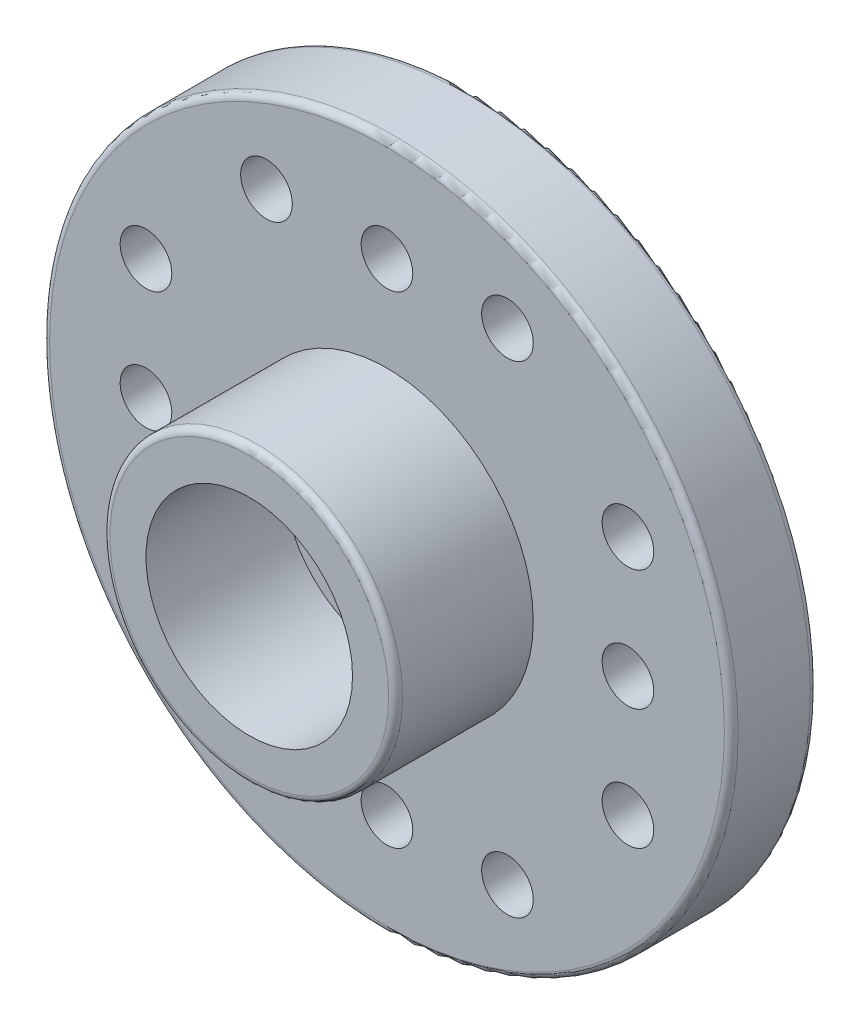
ISO-10303-21;
HEADER;
FILE_DESCRIPTION(('STEP AP214'),'2;1');
FILE_NAME('part.step','',(''),(''),'','','');
FILE_SCHEMA(('AUTOMOTIVE_DESIGN { 1 0 10303 214 1 1 1 1 }'));
ENDSEC;
DATA;
#1=APPLICATION_CONTEXT('core data for automotive mechanical design processes');
#2=APPLICATION_PROTOCOL_DEFINITION('international standard','automotive_design',2000,#1);
#3=PRODUCT_CONTEXT('',#1,'mechanical');
#4=PRODUCT('Part','Part','',(#3));
#5=PRODUCT_RELATED_PRODUCT_CATEGORY('part','',(#4));
#6=PRODUCT_DEFINITION_FORMATION('','',#4);
#7=PRODUCT_DEFINITION_CONTEXT('part definition',#1,'design');
#8=PRODUCT_DEFINITION('design','',#6,#7);
#9=PRODUCT_DEFINITION_SHAPE('','',#8);
#10=(LENGTH_UNIT() NAMED_UNIT(*) SI_UNIT(.MILLI.,.METRE.));
#11=(NAMED_UNIT(*) PLANE_ANGLE_UNIT() SI_UNIT($,.RADIAN.));
#12=(NAMED_UNIT(*) SI_UNIT($,.STERADIAN.) SOLID_ANGLE_UNIT());
#13=UNCERTAINTY_MEASURE_WITH_UNIT(LENGTH_MEASURE(1.E-05),#10,'distance_accuracy_value','');
#14=(GEOMETRIC_REPRESENTATION_CONTEXT(3) GLOBAL_UNCERTAINTY_ASSIGNED_CONTEXT((#13)) GLOBAL_UNIT_ASSIGNED_CONTEXT((#10,
#11,#12)) REPRESENTATION_CONTEXT('',''));
#15=CARTESIAN_POINT('',(0.,0.,0.));
#16=DIRECTION('',(0.,0.,1.));
#17=DIRECTION('',(1.,0.,0.));
#18=AXIS2_PLACEMENT_3D('',#15,#16,#17);
#19=CARTESIAN_POINT('',(0.,0.,0.8));
#20=DIRECTION('',(0.,0.,-1.));
#21=DIRECTION('',(-1.,0.,0.));
#22=AXIS2_PLACEMENT_3D('',#19,#20,#21);
#23=PLANE('',#22);
#24=CARTESIAN_POINT('',(0.,0.,0.8));
#25=DIRECTION('',(0.,0.,-1.));
#26=DIRECTION('',(-1.,0.,0.));
#27=AXIS2_PLACEMENT_3D('',#24,#25,#26);
#28=CIRCLE('',#27,4.5);
#29=CARTESIAN_POINT('',(-4.5,0.,0.8));
#30=VERTEX_POINT('',#29);
#31=EDGE_CURVE('E74',#30,#30,#28,.T.);
#32=ORIENTED_EDGE('',*,*,#31,.T.);
#33=EDGE_LOOP('',(#32));
#34=FACE_BOUND('',#33,.T.);
#35=CARTESIAN_POINT('',(-0.162730826685293,0.,0.8));
#36=DIRECTION('',(0.,0.,-1.));
#37=DIRECTION('',(-1.,0.,0.));
#38=AXIS2_PLACEMENT_3D('',#35,#36,#37);
#39=CIRCLE('',#38,3.7);
#40=CARTESIAN_POINT('',(-3.86273082668529,0.,0.8));
#41=VERTEX_POINT('',#40);
#42=EDGE_CURVE('E162',#41,#41,#39,.T.);
#43=ORIENTED_EDGE('',*,*,#42,.F.);
#44=EDGE_LOOP('',(#43));
#45=FACE_BOUND('',#44,.T.);
#46=ADVANCED_FACE('F34',(#34,#45),#23,.T.);
#47=CARTESIAN_POINT('',(0.,0.,2.5));
#48=DIRECTION('',(0.,0.,-1.));
#49=DIRECTION('',(-1.,0.,0.));
#50=AXIS2_PLACEMENT_3D('',#47,#48,#49);
#51=CYLINDRICAL_SURFACE('',#50,1.5);
#52=CARTESIAN_POINT('',(0.,0.,2.5));
#53=DIRECTION('',(0.,0.,1.));
#54=DIRECTION('',(1.,0.,0.));
#55=AXIS2_PLACEMENT_3D('',#52,#53,#54);
#56=CIRCLE('',#55,1.5);
#57=CARTESIAN_POINT('',(1.5,0.,2.5));
#58=VERTEX_POINT('',#57);
#59=EDGE_CURVE('E147',#58,#58,#56,.T.);
#60=ORIENTED_EDGE('',*,*,#59,.T.);
#61=EDGE_LOOP('',(#60));
#62=FACE_BOUND('',#61,.T.);
#63=CARTESIAN_POINT('',(0.,0.,0.8));
#64=DIRECTION('',(0.,0.,-1.));
#65=DIRECTION('',(-1.,0.,0.));
#66=AXIS2_PLACEMENT_3D('',#63,#64,#65);
#67=CIRCLE('',#66,1.5);
#68=CARTESIAN_POINT('',(-1.5,0.,0.8));
#69=VERTEX_POINT('',#68);
#70=EDGE_CURVE('E70',#69,#69,#67,.T.);
#71=ORIENTED_EDGE('',*,*,#70,.T.);
#72=EDGE_LOOP('',(#71));
#73=FACE_BOUND('',#72,.T.);
#74=ADVANCED_FACE('F172',(#62,#73),#51,.F.);
#75=CARTESIAN_POINT('',(0.,0.,2.5));
#76=DIRECTION('',(0.,0.,1.));
#77=DIRECTION('',(1.,0.,0.));
#78=AXIS2_PLACEMENT_3D('',#75,#76,#77);
#79=PLANE('',#78);
#80=CARTESIAN_POINT('',(0.,0.,2.5));
#81=DIRECTION('',(0.,0.,1.));
#82=DIRECTION('',(1.,0.,0.));
#83=AXIS2_PLACEMENT_3D('',#80,#81,#82);
#84=CIRCLE('',#83,9.79999999999866);
#85=CARTESIAN_POINT('',(9.79999999999866,0.,2.5));
#86=VERTEX_POINT('',#85);
#87=EDGE_CURVE('E10',#86,#86,#84,.T.);
#88=ORIENTED_EDGE('',*,*,#87,.T.);
#89=EDGE_LOOP('',(#88));
#90=FACE_BOUND('',#89,.T.);
#91=CARTESIAN_POINT('',(-7.,3.5,2.5));
#92=DIRECTION('',(0.,0.,1.));
#93=DIRECTION('',(1.,0.,0.));
#94=AXIS2_PLACEMENT_3D('',#91,#92,#93);
#95=CIRCLE('',#94,0.749999999999998);
#96=CARTESIAN_POINT('',(-6.25,3.5,2.5));
#97=VERTEX_POINT('',#96);
#98=EDGE_CURVE('E141',#97,#97,#95,.T.);
#99=ORIENTED_EDGE('',*,*,#98,.F.);
#100=EDGE_LOOP('',(#99));
#101=FACE_BOUND('',#100,.T.);
#102=CARTESIAN_POINT('',(-3.49999999999973,-6.99999999999993,2.5));
#103=DIRECTION('',(0.,0.,1.));
#104=DIRECTION('',(1.,0.,0.));
#105=AXIS2_PLACEMENT_3D('',#102,#103,#104);
#106=CIRCLE('',#105,0.749999999999999);
#107=CARTESIAN_POINT('',(-2.74999999999974,-6.99999999999993,2.5));
#108=VERTEX_POINT('',#107);
#109=EDGE_CURVE('E129',#108,#108,#106,.T.);
#110=ORIENTED_EDGE('',*,*,#109,.F.);
#111=EDGE_LOOP('',(#110));
#112=FACE_BOUND('',#111,.T.);
#113=CARTESIAN_POINT('',(2.65831209225568E-13,-6.99999999999993,2.5));
#114=DIRECTION('',(0.,0.,1.));
#115=DIRECTION('',(1.,0.,0.));
#116=AXIS2_PLACEMENT_3D('',#113,#114,#115);
#117=CIRCLE('',#116,0.749999999999999);
#118=CARTESIAN_POINT('',(0.750000000000265,-6.99999999999993,2.5));
#119=VERTEX_POINT('',#118);
#120=EDGE_CURVE('E117',#119,#119,#117,.T.);
#121=ORIENTED_EDGE('',*,*,#120,.F.);
#122=EDGE_LOOP('',(#121));
#123=FACE_BOUND('',#122,.T.);
#124=CARTESIAN_POINT('',(7.0000000000002,3.50000000000033,2.5));
#125=DIRECTION('',(0.,0.,1.));
#126=DIRECTION('',(1.,0.,0.));
#127=AXIS2_PLACEMENT_3D('',#124,#125,#126);
#128=CIRCLE('',#127,0.749999999999998);
#129=CARTESIAN_POINT('',(7.7500000000002,3.50000000000033,2.5));
#130=VERTEX_POINT('',#129);
#131=EDGE_CURVE('E105',#130,#130,#128,.T.);
#132=ORIENTED_EDGE('',*,*,#131,.F.);
#133=EDGE_LOOP('',(#132));
#134=FACE_BOUND('',#133,.T.);
#135=CARTESIAN_POINT('',(3.49999999999993,7.00000000000027,2.5));
#136=DIRECTION('',(0.,0.,1.));
#137=DIRECTION('',(1.,0.,0.));
#138=AXIS2_PLACEMENT_3D('',#135,#136,#137);
#139=CIRCLE('',#138,0.749999999999999);
#140=CARTESIAN_POINT('',(4.24999999999993,7.00000000000027,2.5));
#141=VERTEX_POINT('',#140);
#142=EDGE_CURVE('E93',#141,#141,#139,.T.);
#143=ORIENTED_EDGE('',*,*,#142,.F.);
#144=EDGE_LOOP('',(#143));
#145=FACE_BOUND('',#144,.T.);
#146=CARTESIAN_POINT('',(0.,7.00000000000026,2.5));
#147=DIRECTION('',(0.,0.,1.));
#148=DIRECTION('',(1.,0.,0.));
#149=AXIS2_PLACEMENT_3D('',#146,#147,#148);
#150=CIRCLE('',#149,0.749999999999999);
#151=CARTESIAN_POINT('',(0.74999999999993,7.00000000000026,2.5));
#152=VERTEX_POINT('',#151);
#153=EDGE_CURVE('E81',#152,#152,#150,.T.);
#154=ORIENTED_EDGE('',*,*,#153,.F.);
#155=EDGE_LOOP('',(#154));
#156=FACE_BOUND('',#155,.T.);
#157=CARTESIAN_POINT('',(-7.,0.,2.5));
#158=DIRECTION('',(0.,0.,1.));
#159=DIRECTION('',(1.,0.,0.));
#160=AXIS2_PLACEMENT_3D('',#157,#158,#159);
#161=CIRCLE('',#160,0.749999999999998);
#162=CARTESIAN_POINT('',(-6.25,0.,2.5));
#163=VERTEX_POINT('',#162);
#164=EDGE_CURVE('E77',#163,#163,#161,.T.);
#165=ORIENTED_EDGE('',*,*,#164,.F.);
#166=EDGE_LOOP('',(#165));
#167=FACE_BOUND('',#166,.T.);
#168=CARTESIAN_POINT('',(-3.50000000000007,7.00000000000027,2.5));
#169=DIRECTION('',(0.,0.,1.));
#170=DIRECTION('',(1.,0.,0.));
#171=AXIS2_PLACEMENT_3D('',#168,#169,#170);
#172=CIRCLE('',#171,0.749999999999998);
#173=CARTESIAN_POINT('',(-2.75000000000007,7.00000000000027,2.5));
#174=VERTEX_POINT('',#173);
#175=EDGE_CURVE('E87',#174,#174,#172,.T.);
#176=ORIENTED_EDGE('',*,*,#175,.F.);
#177=EDGE_LOOP('',(#176));
#178=FACE_BOUND('',#177,.T.);
#179=CARTESIAN_POINT('',(7.0000000000002,3.3392416014695E-13,2.5));
#180=DIRECTION('',(0.,0.,1.));
#181=DIRECTION('',(1.,0.,0.));
#182=AXIS2_PLACEMENT_3D('',#179,#180,#181);
#183=CIRCLE('',#182,0.749999999999999);
#184=CARTESIAN_POINT('',(7.7500000000002,3.3392416014695E-13,2.5));
#185=VERTEX_POINT('',#184);
#186=EDGE_CURVE('E99',#185,#185,#183,.T.);
#187=ORIENTED_EDGE('',*,*,#186,.F.);
#188=EDGE_LOOP('',(#187));
#189=FACE_BOUND('',#188,.T.);
#190=CARTESIAN_POINT('',(7.0000000000002,-3.49999999999967,2.5));
#191=DIRECTION('',(0.,0.,1.));
#192=DIRECTION('',(1.,0.,0.));
#193=AXIS2_PLACEMENT_3D('',#190,#191,#192);
#194=CIRCLE('',#193,0.749999999999998);
#195=CARTESIAN_POINT('',(7.7500000000002,-3.49999999999967,2.5));
#196=VERTEX_POINT('',#195);
#197=EDGE_CURVE('E111',#196,#196,#194,.T.);
#198=ORIENTED_EDGE('',*,*,#197,.F.);
#199=EDGE_LOOP('',(#198));
#200=FACE_BOUND('',#199,.T.);
#201=CARTESIAN_POINT('',(3.50000000000027,-6.99999999999993,2.5));
#202=DIRECTION('',(0.,0.,1.));
#203=DIRECTION('',(1.,0.,0.));
#204=AXIS2_PLACEMENT_3D('',#201,#202,#203);
#205=CIRCLE('',#204,0.749999999999998);
#206=CARTESIAN_POINT('',(4.25000000000026,-6.99999999999993,2.5));
#207=VERTEX_POINT('',#206);
#208=EDGE_CURVE('E123',#207,#207,#205,.T.);
#209=ORIENTED_EDGE('',*,*,#208,.F.);
#210=EDGE_LOOP('',(#209));
#211=FACE_BOUND('',#210,.T.);
#212=CARTESIAN_POINT('',(-7.,-3.5,2.5));
#213=DIRECTION('',(0.,0.,1.));
#214=DIRECTION('',(1.,0.,0.));
#215=AXIS2_PLACEMENT_3D('',#212,#213,#214);
#216=CIRCLE('',#215,0.749999999999998);
#217=CARTESIAN_POINT('',(-6.25,-3.5,2.5));
#218=VERTEX_POINT('',#217);
#219=EDGE_CURVE('E135',#218,#218,#216,.T.);
#220=ORIENTED_EDGE('',*,*,#219,.F.);
#221=EDGE_LOOP('',(#220));
#222=FACE_BOUND('',#221,.T.);
#223=CARTESIAN_POINT('',(0.,0.,2.5));
#224=DIRECTION('',(0.,0.,1.));
#225=DIRECTION('',(1.,0.,0.));
#226=AXIS2_PLACEMENT_3D('',#223,#224,#225);
#227=CIRCLE('',#226,4.25);
#228=CARTESIAN_POINT('',(4.25,0.,2.5));
#229=VERTEX_POINT('',#228);
#230=EDGE_CURVE('E152',#229,#229,#227,.T.);
#231=ORIENTED_EDGE('',*,*,#230,.F.);
#232=EDGE_LOOP('',(#231));
#233=FACE_BOUND('',#232,.T.);
#234=ADVANCED_FACE('F179',(#90,#101,#112,#123,#134,#145,#156,#167,#178,#189,#200,#211,#222,
#233),#79,.T.);
#235=CARTESIAN_POINT('',(0.,0.,2.5));
#236=DIRECTION('',(0.,0.,1.));
#237=DIRECTION('',(1.,0.,0.));
#238=AXIS2_PLACEMENT_3D('',#235,#236,#237);
#239=CIRCLE('',#238,3.);
#240=CARTESIAN_POINT('',(3.,0.,2.5));
#241=VERTEX_POINT('',#240);
#242=EDGE_CURVE('E69',#241,#241,#239,.F.);
#243=ORIENTED_EDGE('',*,*,#242,.F.);
#244=EDGE_LOOP('',(#243));
#245=FACE_BOUND('',#244,.T.);
#246=ORIENTED_EDGE('',*,*,#59,.F.);
#247=EDGE_LOOP('',(#246));
#248=FACE_BOUND('',#247,.T.);
#249=ADVANCED_FACE('F242',(#245,#248),#79,.T.);
#250=CARTESIAN_POINT('',(0.,0.,0.));
#251=DIRECTION('',(0.,0.,1.));
#252=DIRECTION('',(1.,0.,0.));
#253=AXIS2_PLACEMENT_3D('',#250,#251,#252);
#254=PLANE('',#253);
#255=CARTESIAN_POINT('',(0.,0.,0.));
#256=DIRECTION('',(0.,0.,1.));
#257=DIRECTION('',(1.,0.,0.));
#258=AXIS2_PLACEMENT_3D('',#255,#256,#257);
#259=CIRCLE('',#258,4.7);
#260=CARTESIAN_POINT('',(4.7,0.,0.));
#261=VERTEX_POINT('',#260);
#262=EDGE_CURVE('E57',#261,#261,#259,.T.);
#263=ORIENTED_EDGE('',*,*,#262,.T.);
#264=EDGE_LOOP('',(#263));
#265=FACE_BOUND('',#264,.T.);
#266=CARTESIAN_POINT('',(0.,0.,0.));
#267=DIRECTION('',(0.,0.,1.));
#268=DIRECTION('',(1.,0.,0.));
#269=AXIS2_PLACEMENT_3D('',#266,#267,#268);
#270=CIRCLE('',#269,9.79999999999866);
#271=CARTESIAN_POINT('',(9.79999999999866,0.,0.));
#272=VERTEX_POINT('',#271);
#273=EDGE_CURVE('E60',#272,#272,#270,.F.);
#274=ORIENTED_EDGE('',*,*,#273,.T.);
#275=EDGE_LOOP('',(#274));
#276=FACE_BOUND('',#275,.T.);
#277=CARTESIAN_POINT('',(-7.,3.5,0.));
#278=DIRECTION('',(0.,0.,1.));
#279=DIRECTION('',(1.,0.,0.));
#280=AXIS2_PLACEMENT_3D('',#277,#278,#279);
#281=CIRCLE('',#280,0.749999999999998);
#282=CARTESIAN_POINT('',(-6.25,3.5,0.));
#283=VERTEX_POINT('',#282);
#284=EDGE_CURVE('E144',#283,#283,#281,.T.);
#285=ORIENTED_EDGE('',*,*,#284,.T.);
#286=EDGE_LOOP('',(#285));
#287=FACE_BOUND('',#286,.T.);
#288=CARTESIAN_POINT('',(-3.49999999999973,-6.99999999999993,0.));
#289=DIRECTION('',(0.,0.,1.));
#290=DIRECTION('',(1.,0.,0.));
#291=AXIS2_PLACEMENT_3D('',#288,#289,#290);
#292=CIRCLE('',#291,0.749999999999999);
#293=CARTESIAN_POINT('',(-2.74999999999974,-6.99999999999993,0.));
#294=VERTEX_POINT('',#293);
#295=EDGE_CURVE('E132',#294,#294,#292,.T.);
#296=ORIENTED_EDGE('',*,*,#295,.T.);
#297=EDGE_LOOP('',(#296));
#298=FACE_BOUND('',#297,.T.);
#299=CARTESIAN_POINT('',(2.65831209225568E-13,-6.99999999999993,0.));
#300=DIRECTION('',(0.,0.,1.));
#301=DIRECTION('',(1.,0.,0.));
#302=AXIS2_PLACEMENT_3D('',#299,#300,#301);
#303=CIRCLE('',#302,0.749999999999999);
#304=CARTESIAN_POINT('',(0.750000000000265,-6.99999999999993,0.));
#305=VERTEX_POINT('',#304);
#306=EDGE_CURVE('E120',#305,#305,#303,.T.);
#307=ORIENTED_EDGE('',*,*,#306,.T.);
#308=EDGE_LOOP('',(#307));
#309=FACE_BOUND('',#308,.T.);
#310=CARTESIAN_POINT('',(7.0000000000002,3.50000000000033,0.));
#311=DIRECTION('',(0.,0.,1.));
#312=DIRECTION('',(1.,0.,0.));
#313=AXIS2_PLACEMENT_3D('',#310,#311,#312);
#314=CIRCLE('',#313,0.749999999999998);
#315=CARTESIAN_POINT('',(7.7500000000002,3.50000000000033,0.));
#316=VERTEX_POINT('',#315);
#317=EDGE_CURVE('E108',#316,#316,#314,.T.);
#318=ORIENTED_EDGE('',*,*,#317,.T.);
#319=EDGE_LOOP('',(#318));
#320=FACE_BOUND('',#319,.T.);
#321=CARTESIAN_POINT('',(3.49999999999993,7.00000000000027,0.));
#322=DIRECTION('',(0.,0.,1.));
#323=DIRECTION('',(1.,0.,0.));
#324=AXIS2_PLACEMENT_3D('',#321,#322,#323);
#325=CIRCLE('',#324,0.749999999999999);
#326=CARTESIAN_POINT('',(4.24999999999993,7.00000000000027,0.));
#327=VERTEX_POINT('',#326);
#328=EDGE_CURVE('E96',#327,#327,#325,.T.);
#329=ORIENTED_EDGE('',*,*,#328,.T.);
#330=EDGE_LOOP('',(#329));
#331=FACE_BOUND('',#330,.T.);
#332=CARTESIAN_POINT('',(0.,7.00000000000026,0.));
#333=DIRECTION('',(0.,0.,1.));
#334=DIRECTION('',(1.,0.,0.));
#335=AXIS2_PLACEMENT_3D('',#332,#333,#334);
#336=CIRCLE('',#335,0.749999999999999);
#337=CARTESIAN_POINT('',(0.74999999999993,7.00000000000026,0.));
#338=VERTEX_POINT('',#337);
#339=EDGE_CURVE('E84',#338,#338,#336,.T.);
#340=ORIENTED_EDGE('',*,*,#339,.T.);
#341=EDGE_LOOP('',(#340));
#342=FACE_BOUND('',#341,.T.);
#343=CARTESIAN_POINT('',(-7.,0.,0.));
#344=DIRECTION('',(0.,0.,1.));
#345=DIRECTION('',(1.,0.,0.));
#346=AXIS2_PLACEMENT_3D('',#343,#344,#345);
#347=CIRCLE('',#346,0.749999999999998);
#348=CARTESIAN_POINT('',(-6.25,0.,0.));
#349=VERTEX_POINT('',#348);
#350=EDGE_CURVE('E78',#349,#349,#347,.T.);
#351=ORIENTED_EDGE('',*,*,#350,.T.);
#352=EDGE_LOOP('',(#351));
#353=FACE_BOUND('',#352,.T.);
#354=CARTESIAN_POINT('',(-3.50000000000007,7.00000000000027,0.));
#355=DIRECTION('',(0.,0.,1.));
#356=DIRECTION('',(1.,0.,0.));
#357=AXIS2_PLACEMENT_3D('',#354,#355,#356);
#358=CIRCLE('',#357,0.749999999999998);
#359=CARTESIAN_POINT('',(-2.75000000000007,7.00000000000027,0.));
#360=VERTEX_POINT('',#359);
#361=EDGE_CURVE('E90',#360,#360,#358,.T.);
#362=ORIENTED_EDGE('',*,*,#361,.T.);
#363=EDGE_LOOP('',(#362));
#364=FACE_BOUND('',#363,.T.);
#365=CARTESIAN_POINT('',(7.0000000000002,3.3392416014695E-13,0.));
#366=DIRECTION('',(0.,0.,1.));
#367=DIRECTION('',(1.,0.,0.));
#368=AXIS2_PLACEMENT_3D('',#365,#366,#367);
#369=CIRCLE('',#368,0.749999999999999);
#370=CARTESIAN_POINT('',(7.7500000000002,3.3392416014695E-13,0.));
#371=VERTEX_POINT('',#370);
#372=EDGE_CURVE('E102',#371,#371,#369,.T.);
#373=ORIENTED_EDGE('',*,*,#372,.T.);
#374=EDGE_LOOP('',(#373));
#375=FACE_BOUND('',#374,.T.);
#376=CARTESIAN_POINT('',(7.0000000000002,-3.49999999999967,0.));
#377=DIRECTION('',(0.,0.,1.));
#378=DIRECTION('',(1.,0.,0.));
#379=AXIS2_PLACEMENT_3D('',#376,#377,#378);
#380=CIRCLE('',#379,0.749999999999998);
#381=CARTESIAN_POINT('',(7.7500000000002,-3.49999999999967,0.));
#382=VERTEX_POINT('',#381);
#383=EDGE_CURVE('E114',#382,#382,#380,.T.);
#384=ORIENTED_EDGE('',*,*,#383,.T.);
#385=EDGE_LOOP('',(#384));
#386=FACE_BOUND('',#385,.T.);
#387=CARTESIAN_POINT('',(3.50000000000027,-6.99999999999993,0.));
#388=DIRECTION('',(0.,0.,1.));
#389=DIRECTION('',(1.,0.,0.));
#390=AXIS2_PLACEMENT_3D('',#387,#388,#389);
#391=CIRCLE('',#390,0.749999999999998);
#392=CARTESIAN_POINT('',(4.25000000000026,-6.99999999999993,0.));
#393=VERTEX_POINT('',#392);
#394=EDGE_CURVE('E126',#393,#393,#391,.T.);
#395=ORIENTED_EDGE('',*,*,#394,.T.);
#396=EDGE_LOOP('',(#395));
#397=FACE_BOUND('',#396,.T.);
#398=CARTESIAN_POINT('',(-7.,-3.5,0.));
#399=DIRECTION('',(0.,0.,1.));
#400=DIRECTION('',(1.,0.,0.));
#401=AXIS2_PLACEMENT_3D('',#398,#399,#400);
#402=CIRCLE('',#401,0.749999999999998);
#403=CARTESIAN_POINT('',(-6.25,-3.5,0.));
#404=VERTEX_POINT('',#403);
#405=EDGE_CURVE('E138',#404,#404,#402,.T.);
#406=ORIENTED_EDGE('',*,*,#405,.T.);
#407=EDGE_LOOP('',(#406));
#408=FACE_BOUND('',#407,.T.);
#409=ADVANCED_FACE('F239',(#265,#276,#287,#298,#309,#320,#331,#342,#353,#364,#375,#386,#397,
#408),#254,.F.);
#410=CARTESIAN_POINT('',(0.,0.,2.5));
#411=DIRECTION('',(0.,0.,-1.));
#412=DIRECTION('',(-1.,0.,0.));
#413=AXIS2_PLACEMENT_3D('',#410,#411,#412);
#414=CYLINDRICAL_SURFACE('',#413,9.99999999999866);
#415=CARTESIAN_POINT('',(0.,0.,0.2));
#416=DIRECTION('',(0.,0.,1.));
#417=DIRECTION('',(1.,0.,0.));
#418=AXIS2_PLACEMENT_3D('',#415,#416,#417);
#419=CIRCLE('',#418,9.99999999999866);
#420=CARTESIAN_POINT('',(9.99999999999866,0.,0.2));
#421=VERTEX_POINT('',#420);
#422=EDGE_CURVE('E41',#421,#421,#419,.T.);
#423=ORIENTED_EDGE('',*,*,#422,.T.);
#424=EDGE_LOOP('',(#423));
#425=FACE_BOUND('',#424,.T.);
#426=CARTESIAN_POINT('',(0.,0.,2.3));
#427=DIRECTION('',(0.,0.,1.));
#428=DIRECTION('',(1.,0.,0.));
#429=AXIS2_PLACEMENT_3D('',#426,#427,#428);
#430=CIRCLE('',#429,9.99999999999866);
#431=CARTESIAN_POINT('',(9.99999999999866,0.,2.3));
#432=VERTEX_POINT('',#431);
#433=EDGE_CURVE('E45',#432,#432,#430,.F.);
#434=ORIENTED_EDGE('',*,*,#433,.T.);
#435=EDGE_LOOP('',(#434));
#436=FACE_BOUND('',#435,.T.);
#437=ADVANCED_FACE('F228',(#425,#436),#414,.T.);
#438=CARTESIAN_POINT('',(-7.,0.,2.5));
#439=DIRECTION('',(0.,0.,-1.));
#440=DIRECTION('',(-1.,0.,0.));
#441=AXIS2_PLACEMENT_3D('',#438,#439,#440);
#442=CYLINDRICAL_SURFACE('',#441,0.749999999999998);
#443=ORIENTED_EDGE('',*,*,#164,.T.);
#444=EDGE_LOOP('',(#443));
#445=FACE_BOUND('',#444,.T.);
#446=ORIENTED_EDGE('',*,*,#350,.F.);
#447=EDGE_LOOP('',(#446));
#448=FACE_BOUND('',#447,.T.);
#449=ADVANCED_FACE('F315',(#445,#448),#442,.F.);
#450=CARTESIAN_POINT('',(0.,7.00000000000026,2.5));
#451=DIRECTION('',(0.,0.,-1.));
#452=DIRECTION('',(-1.,0.,0.));
#453=AXIS2_PLACEMENT_3D('',#450,#451,#452);
#454=CYLINDRICAL_SURFACE('',#453,0.749999999999999);
#455=ORIENTED_EDGE('',*,*,#153,.T.);
#456=EDGE_LOOP('',(#455));
#457=FACE_BOUND('',#456,.T.);
#458=ORIENTED_EDGE('',*,*,#339,.F.);
#459=EDGE_LOOP('',(#458));
#460=FACE_BOUND('',#459,.T.);
#461=ADVANCED_FACE('F311',(#457,#460),#454,.F.);
#462=CARTESIAN_POINT('',(-3.50000000000007,7.00000000000027,2.5));
#463=DIRECTION('',(0.,0.,-1.));
#464=DIRECTION('',(-1.,0.,0.));
#465=AXIS2_PLACEMENT_3D('',#462,#463,#464);
#466=CYLINDRICAL_SURFACE('',#465,0.749999999999998);
#467=ORIENTED_EDGE('',*,*,#175,.T.);
#468=EDGE_LOOP('',(#467));
#469=FACE_BOUND('',#468,.T.);
#470=ORIENTED_EDGE('',*,*,#361,.F.);
#471=EDGE_LOOP('',(#470));
#472=FACE_BOUND('',#471,.T.);
#473=ADVANCED_FACE('F307',(#469,#472),#466,.F.);
#474=CARTESIAN_POINT('',(3.49999999999993,7.00000000000027,2.5));
#475=DIRECTION('',(0.,0.,-1.));
#476=DIRECTION('',(-1.,0.,0.));
#477=AXIS2_PLACEMENT_3D('',#474,#475,#476);
#478=CYLINDRICAL_SURFACE('',#477,0.749999999999999);
#479=ORIENTED_EDGE('',*,*,#142,.T.);
#480=EDGE_LOOP('',(#479));
#481=FACE_BOUND('',#480,.T.);
#482=ORIENTED_EDGE('',*,*,#328,.F.);
#483=EDGE_LOOP('',(#482));
#484=FACE_BOUND('',#483,.T.);
#485=ADVANCED_FACE('F303',(#481,#484),#478,.F.);
#486=CARTESIAN_POINT('',(7.0000000000002,3.3392416014695E-13,2.5));
#487=DIRECTION('',(0.,0.,-1.));
#488=DIRECTION('',(-1.,0.,0.));
#489=AXIS2_PLACEMENT_3D('',#486,#487,#488);
#490=CYLINDRICAL_SURFACE('',#489,0.749999999999999);
#491=ORIENTED_EDGE('',*,*,#186,.T.);
#492=EDGE_LOOP('',(#491));
#493=FACE_BOUND('',#492,.T.);
#494=ORIENTED_EDGE('',*,*,#372,.F.);
#495=EDGE_LOOP('',(#494));
#496=FACE_BOUND('',#495,.T.);
#497=ADVANCED_FACE('F299',(#493,#496),#490,.F.);
#498=CARTESIAN_POINT('',(7.0000000000002,3.50000000000033,2.5));
#499=DIRECTION('',(0.,0.,-1.));
#500=DIRECTION('',(-1.,0.,0.));
#501=AXIS2_PLACEMENT_3D('',#498,#499,#500);
#502=CYLINDRICAL_SURFACE('',#501,0.749999999999998);
#503=ORIENTED_EDGE('',*,*,#131,.T.);
#504=EDGE_LOOP('',(#503));
#505=FACE_BOUND('',#504,.T.);
#506=ORIENTED_EDGE('',*,*,#317,.F.);
#507=EDGE_LOOP('',(#506));
#508=FACE_BOUND('',#507,.T.);
#509=ADVANCED_FACE('F295',(#505,#508),#502,.F.);
#510=CARTESIAN_POINT('',(7.0000000000002,-3.49999999999967,2.5));
#511=DIRECTION('',(0.,0.,-1.));
#512=DIRECTION('',(-1.,0.,0.));
#513=AXIS2_PLACEMENT_3D('',#510,#511,#512);
#514=CYLINDRICAL_SURFACE('',#513,0.749999999999998);
#515=ORIENTED_EDGE('',*,*,#197,.T.);
#516=EDGE_LOOP('',(#515));
#517=FACE_BOUND('',#516,.T.);
#518=ORIENTED_EDGE('',*,*,#383,.F.);
#519=EDGE_LOOP('',(#518));
#520=FACE_BOUND('',#519,.T.);
#521=ADVANCED_FACE('F291',(#517,#520),#514,.F.);
#522=CARTESIAN_POINT('',(2.65831209225568E-13,-6.99999999999993,2.5));
#523=DIRECTION('',(0.,0.,-1.));
#524=DIRECTION('',(-1.,0.,0.));
#525=AXIS2_PLACEMENT_3D('',#522,#523,#524);
#526=CYLINDRICAL_SURFACE('',#525,0.749999999999999);
#527=ORIENTED_EDGE('',*,*,#120,.T.);
#528=EDGE_LOOP('',(#527));
#529=FACE_BOUND('',#528,.T.);
#530=ORIENTED_EDGE('',*,*,#306,.F.);
#531=EDGE_LOOP('',(#530));
#532=FACE_BOUND('',#531,.T.);
#533=ADVANCED_FACE('F287',(#529,#532),#526,.F.);
#534=CARTESIAN_POINT('',(3.50000000000027,-6.99999999999993,2.5));
#535=DIRECTION('',(0.,0.,-1.));
#536=DIRECTION('',(-1.,0.,0.));
#537=AXIS2_PLACEMENT_3D('',#534,#535,#536);
#538=CYLINDRICAL_SURFACE('',#537,0.749999999999998);
#539=ORIENTED_EDGE('',*,*,#208,.T.);
#540=EDGE_LOOP('',(#539));
#541=FACE_BOUND('',#540,.T.);
#542=ORIENTED_EDGE('',*,*,#394,.F.);
#543=EDGE_LOOP('',(#542));
#544=FACE_BOUND('',#543,.T.);
#545=ADVANCED_FACE('F281',(#541,#544),#538,.F.);
#546=CARTESIAN_POINT('',(-3.49999999999973,-6.99999999999993,2.5));
#547=DIRECTION('',(0.,0.,-1.));
#548=DIRECTION('',(-1.,0.,0.));
#549=AXIS2_PLACEMENT_3D('',#546,#547,#548);
#550=CYLINDRICAL_SURFACE('',#549,0.749999999999999);
#551=ORIENTED_EDGE('',*,*,#109,.T.);
#552=EDGE_LOOP('',(#551));
#553=FACE_BOUND('',#552,.T.);
#554=ORIENTED_EDGE('',*,*,#295,.F.);
#555=EDGE_LOOP('',(#554));
#556=FACE_BOUND('',#555,.T.);
#557=ADVANCED_FACE('F271',(#553,#556),#550,.F.);
#558=CARTESIAN_POINT('',(-7.,-3.5,2.5));
#559=DIRECTION('',(0.,0.,-1.));
#560=DIRECTION('',(-1.,0.,0.));
#561=AXIS2_PLACEMENT_3D('',#558,#559,#560);
#562=CYLINDRICAL_SURFACE('',#561,0.749999999999998);
#563=ORIENTED_EDGE('',*,*,#219,.T.);
#564=EDGE_LOOP('',(#563));
#565=FACE_BOUND('',#564,.T.);
#566=ORIENTED_EDGE('',*,*,#405,.F.);
#567=EDGE_LOOP('',(#566));
#568=FACE_BOUND('',#567,.T.);
#569=ADVANCED_FACE('F268',(#565,#568),#562,.F.);
#570=CARTESIAN_POINT('',(-7.,3.5,2.5));
#571=DIRECTION('',(0.,0.,-1.));
#572=DIRECTION('',(-1.,0.,0.));
#573=AXIS2_PLACEMENT_3D('',#570,#571,#572);
#574=CYLINDRICAL_SURFACE('',#573,0.749999999999998);
#575=ORIENTED_EDGE('',*,*,#98,.T.);
#576=EDGE_LOOP('',(#575));
#577=FACE_BOUND('',#576,.T.);
#578=ORIENTED_EDGE('',*,*,#284,.F.);
#579=EDGE_LOOP('',(#578));
#580=FACE_BOUND('',#579,.T.);
#581=ADVANCED_FACE('F270',(#577,#580),#574,.F.);
#582=CARTESIAN_POINT('',(0.,0.,6.5));
#583=DIRECTION('',(0.,0.,1.));
#584=DIRECTION('',(1.,0.,0.));
#585=AXIS2_PLACEMENT_3D('',#582,#583,#584);
#586=PLANE('',#585);
#587=CARTESIAN_POINT('',(0.,0.,6.5));
#588=DIRECTION('',(0.,0.,1.));
#589=DIRECTION('',(1.,0.,0.));
#590=AXIS2_PLACEMENT_3D('',#587,#588,#589);
#591=CIRCLE('',#590,4.05);
#592=CARTESIAN_POINT('',(4.05,0.,6.5));
#593=VERTEX_POINT('',#592);
#594=EDGE_CURVE('E54',#593,#593,#591,.T.);
#595=ORIENTED_EDGE('',*,*,#594,.T.);
#596=EDGE_LOOP('',(#595));
#597=FACE_BOUND('',#596,.T.);
#598=CARTESIAN_POINT('',(0.,0.,6.5));
#599=DIRECTION('',(0.,0.,1.));
#600=DIRECTION('',(1.,0.,0.));
#601=AXIS2_PLACEMENT_3D('',#598,#599,#600);
#602=CIRCLE('',#601,3.);
#603=CARTESIAN_POINT('',(3.,0.,6.5));
#604=VERTEX_POINT('',#603);
#605=EDGE_CURVE('E73',#604,#604,#602,.T.);
#606=ORIENTED_EDGE('',*,*,#605,.F.);
#607=EDGE_LOOP('',(#606));
#608=FACE_BOUND('',#607,.T.);
#609=ADVANCED_FACE('F278',(#597,#608),#586,.T.);
#610=CARTESIAN_POINT('',(0.,0.,6.5));
#611=DIRECTION('',(0.,0.,-1.));
#612=DIRECTION('',(-1.,0.,0.));
#613=AXIS2_PLACEMENT_3D('',#610,#611,#612);
#614=CYLINDRICAL_SURFACE('',#613,4.25);
#615=CARTESIAN_POINT('',(0.,0.,6.3));
#616=DIRECTION('',(0.,0.,1.));
#617=DIRECTION('',(1.,0.,0.));
#618=AXIS2_PLACEMENT_3D('',#615,#616,#617);
#619=CIRCLE('',#618,4.25);
#620=CARTESIAN_POINT('',(4.25,0.,6.3));
#621=VERTEX_POINT('',#620);
#622=EDGE_CURVE('E49',#621,#621,#619,.F.);
#623=ORIENTED_EDGE('',*,*,#622,.T.);
#624=EDGE_LOOP('',(#623));
#625=FACE_BOUND('',#624,.T.);
#626=ORIENTED_EDGE('',*,*,#230,.T.);
#627=EDGE_LOOP('',(#626));
#628=FACE_BOUND('',#627,.T.);
#629=ADVANCED_FACE('F330',(#625,#628),#614,.T.);
#630=CARTESIAN_POINT('',(0.,0.,6.5));
#631=DIRECTION('',(0.,0.,-1.));
#632=DIRECTION('',(-1.,0.,0.));
#633=AXIS2_PLACEMENT_3D('',#630,#631,#632);
#634=CYLINDRICAL_SURFACE('',#633,3.);
#635=ORIENTED_EDGE('',*,*,#605,.T.);
#636=EDGE_LOOP('',(#635));
#637=FACE_BOUND('',#636,.T.);
#638=ORIENTED_EDGE('',*,*,#242,.T.);
#639=EDGE_LOOP('',(#638));
#640=FACE_BOUND('',#639,.T.);
#641=ADVANCED_FACE('F194',(#637,#640),#634,.F.);
#642=CARTESIAN_POINT('',(0.,0.,0.8));
#643=DIRECTION('',(0.,0.,-1.));
#644=DIRECTION('',(-1.,0.,0.));
#645=AXIS2_PLACEMENT_3D('',#642,#643,#644);
#646=CYLINDRICAL_SURFACE('',#645,4.5);
#647=CARTESIAN_POINT('',(0.,0.,0.2));
#648=DIRECTION('',(0.,0.,1.));
#649=DIRECTION('',(1.,0.,0.));
#650=AXIS2_PLACEMENT_3D('',#647,#648,#649);
#651=CIRCLE('',#650,4.5);
#652=CARTESIAN_POINT('',(4.5,0.,0.2));
#653=VERTEX_POINT('',#652);
#654=EDGE_CURVE('E63',#653,#653,#651,.F.);
#655=ORIENTED_EDGE('',*,*,#654,.T.);
#656=EDGE_LOOP('',(#655));
#657=FACE_BOUND('',#656,.T.);
#658=ORIENTED_EDGE('',*,*,#31,.F.);
#659=EDGE_LOOP('',(#658));
#660=FACE_BOUND('',#659,.T.);
#661=ADVANCED_FACE('F185',(#657,#660),#646,.F.);
#662=CARTESIAN_POINT('',(-0.162730826685293,0.,0.8));
#663=DIRECTION('',(0.,0.,-1.));
#664=DIRECTION('',(-1.,0.,0.));
#665=AXIS2_PLACEMENT_3D('',#662,#663,#664);
#666=CIRCLE('',#665,3.5);
#667=CARTESIAN_POINT('',(-3.66273082668529,0.,0.8));
#668=VERTEX_POINT('',#667);
#669=EDGE_CURVE('E66',#668,#668,#666,.F.);
#670=ORIENTED_EDGE('',*,*,#669,.F.);
#671=EDGE_LOOP('',(#670));
#672=FACE_BOUND('',#671,.T.);
#673=ORIENTED_EDGE('',*,*,#70,.F.);
#674=EDGE_LOOP('',(#673));
#675=FACE_BOUND('',#674,.T.);
#676=ADVANCED_FACE('F175',(#672,#675),#23,.T.);
#677=CARTESIAN_POINT('',(-0.162730826685293,0.,-10.4651803615609));
#678=DIRECTION('',(0.,0.,1.));
#679=DIRECTION('',(1.,0.,0.));
#680=AXIS2_PLACEMENT_3D('',#677,#678,#679);
#681=CYLINDRICAL_SURFACE('',#680,3.7);
#682=CARTESIAN_POINT('',(-0.162730826685293,0.,0.));
#683=DIRECTION('',(0.,0.,1.));
#684=DIRECTION('',(1.,0.,0.));
#685=AXIS2_PLACEMENT_3D('',#682,#683,#684);
#686=CIRCLE('',#685,3.7);
#687=CARTESIAN_POINT('',(3.53726917331471,0.,0.));
#688=VERTEX_POINT('',#687);
#689=EDGE_CURVE('E163',#688,#688,#686,.T.);
#690=ORIENTED_EDGE('',*,*,#689,.T.);
#691=EDGE_LOOP('',(#690));
#692=FACE_BOUND('',#691,.T.);
#693=ORIENTED_EDGE('',*,*,#42,.T.);
#694=EDGE_LOOP('',(#693));
#695=FACE_BOUND('',#694,.T.);
#696=ADVANCED_FACE('F169',(#692,#695),#681,.T.);
#697=CARTESIAN_POINT('',(-0.162730826685293,0.,-10.4651803615609));
#698=DIRECTION('',(0.,0.,1.));
#699=DIRECTION('',(1.,0.,0.));
#700=AXIS2_PLACEMENT_3D('',#697,#698,#699);
#701=CYLINDRICAL_SURFACE('',#700,3.5);
#702=CARTESIAN_POINT('',(-0.162730826685293,0.,0.));
#703=DIRECTION('',(0.,0.,1.));
#704=DIRECTION('',(1.,0.,0.));
#705=AXIS2_PLACEMENT_3D('',#702,#703,#704);
#706=CIRCLE('',#705,3.5);
#707=CARTESIAN_POINT('',(3.33726917331471,0.,0.));
#708=VERTEX_POINT('',#707);
#709=EDGE_CURVE('E159',#708,#708,#706,.T.);
#710=ORIENTED_EDGE('',*,*,#709,.F.);
#711=EDGE_LOOP('',(#710));
#712=FACE_BOUND('',#711,.T.);
#713=ORIENTED_EDGE('',*,*,#669,.T.);
#714=EDGE_LOOP('',(#713));
#715=FACE_BOUND('',#714,.T.);
#716=ADVANCED_FACE('F191',(#712,#715),#701,.F.);
#717=CARTESIAN_POINT('',(0.,0.,0.));
#718=DIRECTION('',(0.,0.,1.));
#719=DIRECTION('',(1.,0.,0.));
#720=AXIS2_PLACEMENT_3D('',#717,#718,#719);
#721=PLANE('',#720);
#722=ORIENTED_EDGE('',*,*,#709,.T.);
#723=EDGE_LOOP('',(#722));
#724=FACE_BOUND('',#723,.T.);
#725=ORIENTED_EDGE('',*,*,#689,.F.);
#726=EDGE_LOOP('',(#725));
#727=FACE_BOUND('',#726,.T.);
#728=ADVANCED_FACE('F202',(#724,#727),#721,.F.);
#729=CARTESIAN_POINT('',(0.,0.,0.2));
#730=DIRECTION('',(0.,0.,1.));
#731=DIRECTION('',(1.,0.,0.));
#732=AXIS2_PLACEMENT_3D('',#729,#730,#731);
#733=TOROIDAL_SURFACE('',#732,4.7,0.2);
#734=ORIENTED_EDGE('',*,*,#262,.F.);
#735=EDGE_LOOP('',(#734));
#736=FACE_BOUND('',#735,.T.);
#737=ORIENTED_EDGE('',*,*,#654,.F.);
#738=EDGE_LOOP('',(#737));
#739=FACE_BOUND('',#738,.T.);
#740=ADVANCED_FACE('F208',(#736,#739),#733,.T.);
#741=CARTESIAN_POINT('',(0.,0.,6.3));
#742=DIRECTION('',(0.,0.,1.));
#743=DIRECTION('',(1.,0.,0.));
#744=AXIS2_PLACEMENT_3D('',#741,#742,#743);
#745=TOROIDAL_SURFACE('',#744,4.05,0.2);
#746=ORIENTED_EDGE('',*,*,#622,.F.);
#747=EDGE_LOOP('',(#746));
#748=FACE_BOUND('',#747,.T.);
#749=ORIENTED_EDGE('',*,*,#594,.F.);
#750=EDGE_LOOP('',(#749));
#751=FACE_BOUND('',#750,.T.);
#752=ADVANCED_FACE('F216',(#748,#751),#745,.T.);
#753=CARTESIAN_POINT('',(0.,0.,0.2));
#754=DIRECTION('',(0.,0.,1.));
#755=DIRECTION('',(1.,0.,0.));
#756=AXIS2_PLACEMENT_3D('',#753,#754,#755);
#757=TOROIDAL_SURFACE('',#756,9.79999999999866,0.2);
#758=ORIENTED_EDGE('',*,*,#273,.F.);
#759=EDGE_LOOP('',(#758));
#760=FACE_BOUND('',#759,.T.);
#761=ORIENTED_EDGE('',*,*,#422,.F.);
#762=EDGE_LOOP('',(#761));
#763=FACE_BOUND('',#762,.T.);
#764=ADVANCED_FACE('F222',(#760,#763),#757,.T.);
#765=CARTESIAN_POINT('',(0.,0.,2.3));
#766=DIRECTION('',(0.,0.,1.));
#767=DIRECTION('',(1.,0.,0.));
#768=AXIS2_PLACEMENT_3D('',#765,#766,#767);
#769=TOROIDAL_SURFACE('',#768,9.79999999999866,0.2);
#770=ORIENTED_EDGE('',*,*,#433,.F.);
#771=EDGE_LOOP('',(#770));
#772=FACE_BOUND('',#771,.T.);
#773=ORIENTED_EDGE('',*,*,#87,.F.);
#774=EDGE_LOOP('',(#773));
#775=FACE_BOUND('',#774,.T.);
#776=ADVANCED_FACE('F36',(#772,#775),#769,.T.);
#777=CLOSED_SHELL('',(#46,#74,#234,#249,#409,#437,#449,#461,#473,#485,#497,#509,#521,#533,#545,
#557,#569,#581,#609,#629,#641,#661,#676,#696,#716,#728,#740,#752,#764,#776));
#778=MANIFOLD_SOLID_BREP('B2',#777);
#779=ADVANCED_BREP_SHAPE_REPRESENTATION('',(#18,#778),#14);
#780=SHAPE_DEFINITION_REPRESENTATION(#9,#779);
ENDSEC;
END-ISO-10303-21;
